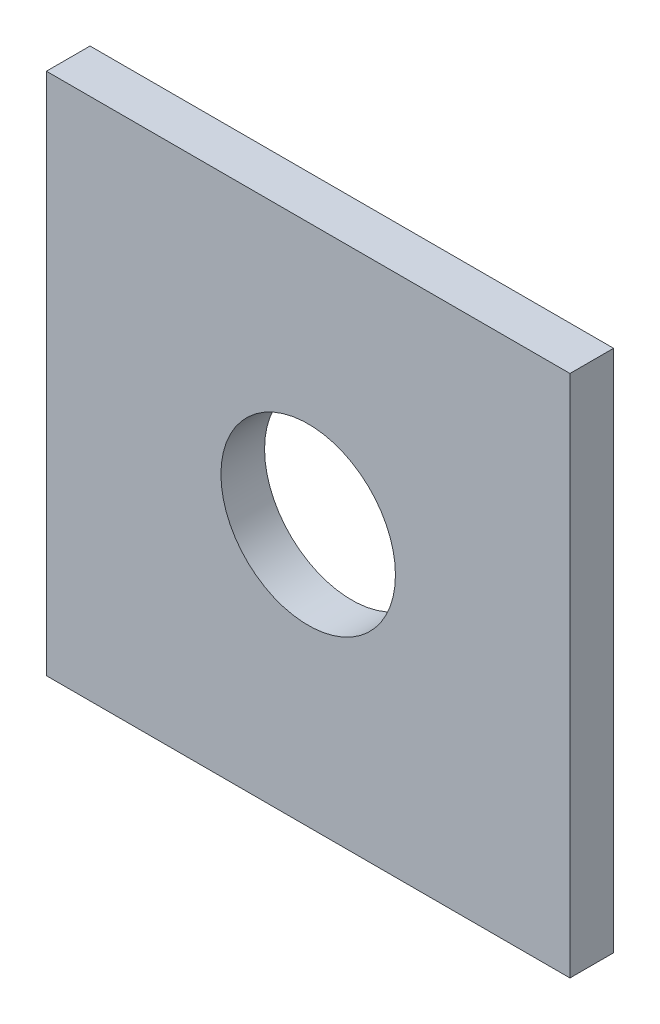
ISO-10303-21;
HEADER;
FILE_DESCRIPTION(('STEP AP214'),'2;1');
FILE_NAME('part.step','',(''),(''),'','','');
FILE_SCHEMA(('AUTOMOTIVE_DESIGN { 1 0 10303 214 1 1 1 1 }'));
ENDSEC;
DATA;
#1=APPLICATION_CONTEXT('core data for automotive mechanical design processes');
#2=APPLICATION_PROTOCOL_DEFINITION('international standard','automotive_design',2000,#1);
#3=PRODUCT_CONTEXT('',#1,'mechanical');
#4=PRODUCT('Part','Part','',(#3));
#5=PRODUCT_RELATED_PRODUCT_CATEGORY('part','',(#4));
#6=PRODUCT_DEFINITION_FORMATION('','',#4);
#7=PRODUCT_DEFINITION_CONTEXT('part definition',#1,'design');
#8=PRODUCT_DEFINITION('design','',#6,#7);
#9=PRODUCT_DEFINITION_SHAPE('','',#8);
#10=(LENGTH_UNIT() NAMED_UNIT(*) SI_UNIT(.MILLI.,.METRE.));
#11=(NAMED_UNIT(*) PLANE_ANGLE_UNIT() SI_UNIT($,.RADIAN.));
#12=(NAMED_UNIT(*) SI_UNIT($,.STERADIAN.) SOLID_ANGLE_UNIT());
#13=UNCERTAINTY_MEASURE_WITH_UNIT(LENGTH_MEASURE(1.E-05),#10,'distance_accuracy_value','');
#14=(GEOMETRIC_REPRESENTATION_CONTEXT(3) GLOBAL_UNCERTAINTY_ASSIGNED_CONTEXT((#13)) GLOBAL_UNIT_ASSIGNED_CONTEXT((#10,
#11,#12)) REPRESENTATION_CONTEXT('',''));
#15=CARTESIAN_POINT('',(0.,0.,0.));
#16=DIRECTION('',(0.,0.,1.));
#17=DIRECTION('',(1.,0.,0.));
#18=AXIS2_PLACEMENT_3D('',#15,#16,#17);
#19=CARTESIAN_POINT('',(0.,0.,12.7));
#20=DIRECTION('',(1.,0.,0.));
#21=DIRECTION('',(0.,0.,-1.));
#22=AXIS2_PLACEMENT_3D('',#19,#20,#21);
#23=PLANE('',#22);
#24=DIRECTION('',(0.,-1.,0.));
#25=VECTOR('',#24,1.);
#26=CARTESIAN_POINT('',(0.,0.,0.));
#27=LINE('',#26,#25);
#28=CARTESIAN_POINT('',(0.,152.4,0.));
#29=VERTEX_POINT('',#28);
#30=CARTESIAN_POINT('',(0.,0.,0.));
#31=VERTEX_POINT('',#30);
#32=EDGE_CURVE('E98',#29,#31,#27,.T.);
#33=ORIENTED_EDGE('',*,*,#32,.T.);
#34=DIRECTION('',(0.,0.,-1.));
#35=VECTOR('',#34,1.);
#36=CARTESIAN_POINT('',(0.,0.,12.7));
#37=LINE('',#36,#35);
#38=CARTESIAN_POINT('',(0.,0.,12.7));
#39=VERTEX_POINT('',#38);
#40=EDGE_CURVE('E11',#39,#31,#37,.T.);
#41=ORIENTED_EDGE('',*,*,#40,.F.);
#42=DIRECTION('',(0.,-1.,0.));
#43=VECTOR('',#42,1.);
#44=CARTESIAN_POINT('',(0.,0.,12.7));
#45=LINE('',#44,#43);
#46=CARTESIAN_POINT('',(0.,152.4,12.7));
#47=VERTEX_POINT('',#46);
#48=EDGE_CURVE('E86',#47,#39,#45,.T.);
#49=ORIENTED_EDGE('',*,*,#48,.F.);
#50=DIRECTION('',(0.,0.,-1.));
#51=VECTOR('',#50,1.);
#52=CARTESIAN_POINT('',(0.,152.4,12.7));
#53=LINE('',#52,#51);
#54=EDGE_CURVE('E94',#47,#29,#53,.T.);
#55=ORIENTED_EDGE('',*,*,#54,.T.);
#56=EDGE_LOOP('',(#33,#41,#49,#55));
#57=FACE_BOUND('',#56,.T.);
#58=ADVANCED_FACE('F35',(#57),#23,.F.);
#59=CARTESIAN_POINT('',(0.,0.,12.7));
#60=DIRECTION('',(0.,1.,0.));
#61=DIRECTION('',(0.,0.,1.));
#62=AXIS2_PLACEMENT_3D('',#59,#60,#61);
#63=PLANE('',#62);
#64=DIRECTION('',(1.,0.,0.));
#65=VECTOR('',#64,1.);
#66=CARTESIAN_POINT('',(0.,0.,0.));
#67=LINE('',#66,#65);
#68=CARTESIAN_POINT('',(152.4,0.,0.));
#69=VERTEX_POINT('',#68);
#70=EDGE_CURVE('E90',#31,#69,#67,.T.);
#71=ORIENTED_EDGE('',*,*,#70,.T.);
#72=DIRECTION('',(0.,0.,-1.));
#73=VECTOR('',#72,1.);
#74=CARTESIAN_POINT('',(152.4,0.,12.7));
#75=LINE('',#74,#73);
#76=CARTESIAN_POINT('',(152.4,0.,12.7));
#77=VERTEX_POINT('',#76);
#78=EDGE_CURVE('E43',#77,#69,#75,.T.);
#79=ORIENTED_EDGE('',*,*,#78,.F.);
#80=DIRECTION('',(1.,0.,0.));
#81=VECTOR('',#80,1.);
#82=CARTESIAN_POINT('',(0.,0.,12.7));
#83=LINE('',#82,#81);
#84=EDGE_CURVE('E81',#39,#77,#83,.T.);
#85=ORIENTED_EDGE('',*,*,#84,.F.);
#86=ORIENTED_EDGE('',*,*,#40,.T.);
#87=EDGE_LOOP('',(#71,#79,#85,#86));
#88=FACE_BOUND('',#87,.T.);
#89=ADVANCED_FACE('F89',(#88),#63,.F.);
#90=CARTESIAN_POINT('',(152.4,0.,12.7));
#91=DIRECTION('',(-1.,0.,0.));
#92=DIRECTION('',(0.,0.,1.));
#93=AXIS2_PLACEMENT_3D('',#90,#91,#92);
#94=PLANE('',#93);
#95=DIRECTION('',(0.,1.,0.));
#96=VECTOR('',#95,1.);
#97=CARTESIAN_POINT('',(152.4,0.,0.));
#98=LINE('',#97,#96);
#99=CARTESIAN_POINT('',(152.4,152.4,0.));
#100=VERTEX_POINT('',#99);
#101=EDGE_CURVE('E68',#69,#100,#98,.T.);
#102=ORIENTED_EDGE('',*,*,#101,.T.);
#103=DIRECTION('',(0.,0.,-1.));
#104=VECTOR('',#103,1.);
#105=CARTESIAN_POINT('',(152.4,152.4,12.7));
#106=LINE('',#105,#104);
#107=CARTESIAN_POINT('',(152.4,152.4,12.7));
#108=VERTEX_POINT('',#107);
#109=EDGE_CURVE('E91',#108,#100,#106,.T.);
#110=ORIENTED_EDGE('',*,*,#109,.F.);
#111=DIRECTION('',(0.,1.,0.));
#112=VECTOR('',#111,1.);
#113=CARTESIAN_POINT('',(152.4,0.,12.7));
#114=LINE('',#113,#112);
#115=EDGE_CURVE('E84',#77,#108,#114,.T.);
#116=ORIENTED_EDGE('',*,*,#115,.F.);
#117=ORIENTED_EDGE('',*,*,#78,.T.);
#118=EDGE_LOOP('',(#102,#110,#116,#117));
#119=FACE_BOUND('',#118,.T.);
#120=ADVANCED_FACE('F92',(#119),#94,.F.);
#121=CARTESIAN_POINT('',(0.,152.4,12.7));
#122=DIRECTION('',(0.,-1.,0.));
#123=DIRECTION('',(0.,0.,-1.));
#124=AXIS2_PLACEMENT_3D('',#121,#122,#123);
#125=PLANE('',#124);
#126=DIRECTION('',(-1.,0.,0.));
#127=VECTOR('',#126,1.);
#128=CARTESIAN_POINT('',(0.,152.4,0.));
#129=LINE('',#128,#127);
#130=EDGE_CURVE('E74',#100,#29,#129,.T.);
#131=ORIENTED_EDGE('',*,*,#130,.T.);
#132=ORIENTED_EDGE('',*,*,#54,.F.);
#133=DIRECTION('',(-1.,0.,0.));
#134=VECTOR('',#133,1.);
#135=CARTESIAN_POINT('',(0.,152.4,12.7));
#136=LINE('',#135,#134);
#137=EDGE_CURVE('E51',#108,#47,#136,.T.);
#138=ORIENTED_EDGE('',*,*,#137,.F.);
#139=ORIENTED_EDGE('',*,*,#109,.T.);
#140=EDGE_LOOP('',(#131,#132,#138,#139));
#141=FACE_BOUND('',#140,.T.);
#142=ADVANCED_FACE('F106',(#141),#125,.F.);
#143=CARTESIAN_POINT('',(0.,0.,12.7));
#144=DIRECTION('',(0.,0.,-1.));
#145=DIRECTION('',(-1.,0.,0.));
#146=AXIS2_PLACEMENT_3D('',#143,#144,#145);
#147=PLANE('',#146);
#148=CARTESIAN_POINT('',(76.2,76.2,12.7));
#149=DIRECTION('',(0.,0.,-1.));
#150=DIRECTION('',(-1.,0.,0.));
#151=AXIS2_PLACEMENT_3D('',#148,#149,#150);
#152=CIRCLE('',#151,25.4);
#153=CARTESIAN_POINT('',(50.8,76.2,12.7));
#154=VERTEX_POINT('',#153);
#155=EDGE_CURVE('E101',#154,#154,#152,.T.);
#156=ORIENTED_EDGE('',*,*,#155,.T.);
#157=EDGE_LOOP('',(#156));
#158=FACE_BOUND('',#157,.T.);
#159=ORIENTED_EDGE('',*,*,#48,.T.);
#160=ORIENTED_EDGE('',*,*,#84,.T.);
#161=ORIENTED_EDGE('',*,*,#115,.T.);
#162=ORIENTED_EDGE('',*,*,#137,.T.);
#163=EDGE_LOOP('',(#159,#160,#161,#162));
#164=FACE_BOUND('',#163,.T.);
#165=ADVANCED_FACE('F82',(#158,#164),#147,.F.);
#166=CARTESIAN_POINT('',(0.,0.,0.));
#167=DIRECTION('',(0.,0.,-1.));
#168=DIRECTION('',(-1.,0.,0.));
#169=AXIS2_PLACEMENT_3D('',#166,#167,#168);
#170=PLANE('',#169);
#171=CARTESIAN_POINT('',(76.2,76.2,0.));
#172=DIRECTION('',(0.,0.,-1.));
#173=DIRECTION('',(-1.,0.,0.));
#174=AXIS2_PLACEMENT_3D('',#171,#172,#173);
#175=CIRCLE('',#174,25.4);
#176=CARTESIAN_POINT('',(50.8,76.2,0.));
#177=VERTEX_POINT('',#176);
#178=EDGE_CURVE('E112',#177,#177,#175,.T.);
#179=ORIENTED_EDGE('',*,*,#178,.F.);
#180=EDGE_LOOP('',(#179));
#181=FACE_BOUND('',#180,.T.);
#182=ORIENTED_EDGE('',*,*,#32,.F.);
#183=ORIENTED_EDGE('',*,*,#130,.F.);
#184=ORIENTED_EDGE('',*,*,#101,.F.);
#185=ORIENTED_EDGE('',*,*,#70,.F.);
#186=EDGE_LOOP('',(#182,#183,#184,#185));
#187=FACE_BOUND('',#186,.T.);
#188=ADVANCED_FACE('F109',(#181,#187),#170,.T.);
#189=CARTESIAN_POINT('',(76.2,76.2,12.7));
#190=DIRECTION('',(0.,0.,-1.));
#191=DIRECTION('',(-1.,0.,0.));
#192=AXIS2_PLACEMENT_3D('',#189,#190,#191);
#193=CYLINDRICAL_SURFACE('',#192,25.4);
#194=ORIENTED_EDGE('',*,*,#155,.F.);
#195=EDGE_LOOP('',(#194));
#196=FACE_BOUND('',#195,.T.);
#197=ORIENTED_EDGE('',*,*,#178,.T.);
#198=EDGE_LOOP('',(#197));
#199=FACE_BOUND('',#198,.T.);
#200=ADVANCED_FACE('F119',(#196,#199),#193,.F.);
#201=CLOSED_SHELL('',(#58,#89,#120,#142,#165,#188,#200));
#202=MANIFOLD_SOLID_BREP('B2',#201);
#203=ADVANCED_BREP_SHAPE_REPRESENTATION('',(#18,#202),#14);
#204=SHAPE_DEFINITION_REPRESENTATION(#9,#203);
ENDSEC;
END-ISO-10303-21;
